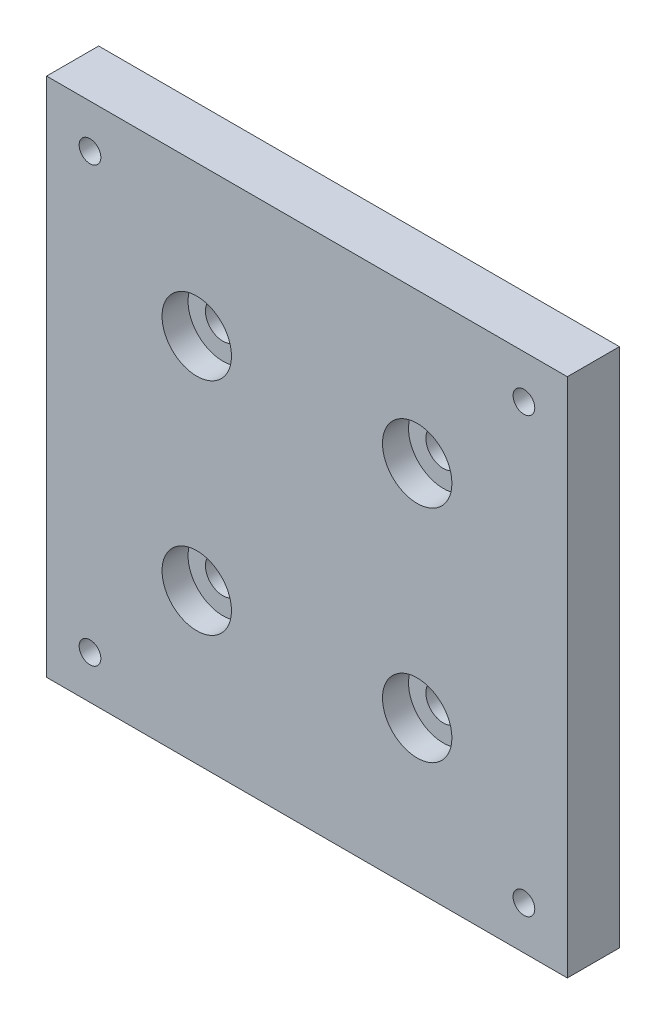
ISO-10303-21;
HEADER;
FILE_DESCRIPTION(('STEP AP214'),'2;1');
FILE_NAME('part.step','',(''),(''),'','','');
FILE_SCHEMA(('AUTOMOTIVE_DESIGN { 1 0 10303 214 1 1 1 1 }'));
ENDSEC;
DATA;
#1=APPLICATION_CONTEXT('core data for automotive mechanical design processes');
#2=APPLICATION_PROTOCOL_DEFINITION('international standard','automotive_design',2000,#1);
#3=PRODUCT_CONTEXT('',#1,'mechanical');
#4=PRODUCT('Part','Part','',(#3));
#5=PRODUCT_RELATED_PRODUCT_CATEGORY('part','',(#4));
#6=PRODUCT_DEFINITION_FORMATION('','',#4);
#7=PRODUCT_DEFINITION_CONTEXT('part definition',#1,'design');
#8=PRODUCT_DEFINITION('design','',#6,#7);
#9=PRODUCT_DEFINITION_SHAPE('','',#8);
#10=(LENGTH_UNIT() NAMED_UNIT(*) SI_UNIT(.MILLI.,.METRE.));
#11=(NAMED_UNIT(*) PLANE_ANGLE_UNIT() SI_UNIT($,.RADIAN.));
#12=(NAMED_UNIT(*) SI_UNIT($,.STERADIAN.) SOLID_ANGLE_UNIT());
#13=UNCERTAINTY_MEASURE_WITH_UNIT(LENGTH_MEASURE(1.E-05),#10,'distance_accuracy_value','');
#14=(GEOMETRIC_REPRESENTATION_CONTEXT(3) GLOBAL_UNCERTAINTY_ASSIGNED_CONTEXT((#13)) GLOBAL_UNIT_ASSIGNED_CONTEXT((#10,
#11,#12)) REPRESENTATION_CONTEXT('',''));
#15=CARTESIAN_POINT('',(0.,0.,0.));
#16=DIRECTION('',(0.,0.,1.));
#17=DIRECTION('',(1.,0.,0.));
#18=AXIS2_PLACEMENT_3D('',#15,#16,#17);
#19=CARTESIAN_POINT('',(30.,30.,6.));
#20=DIRECTION('',(-1.,0.,0.));
#21=DIRECTION('',(0.,0.,1.));
#22=AXIS2_PLACEMENT_3D('',#19,#20,#21);
#23=PLANE('',#22);
#24=DIRECTION('',(0.,1.,0.));
#25=VECTOR('',#24,1.);
#26=CARTESIAN_POINT('',(30.,30.,0.));
#27=LINE('',#26,#25);
#28=CARTESIAN_POINT('',(30.,-30.,0.));
#29=VERTEX_POINT('',#28);
#30=CARTESIAN_POINT('',(30.,30.,0.));
#31=VERTEX_POINT('',#30);
#32=EDGE_CURVE('E109',#29,#31,#27,.T.);
#33=ORIENTED_EDGE('',*,*,#32,.T.);
#34=DIRECTION('',(0.,0.,-1.));
#35=VECTOR('',#34,1.);
#36=CARTESIAN_POINT('',(30.,30.,6.));
#37=LINE('',#36,#35);
#38=CARTESIAN_POINT('',(30.,30.,6.));
#39=VERTEX_POINT('',#38);
#40=EDGE_CURVE('E11',#39,#31,#37,.T.);
#41=ORIENTED_EDGE('',*,*,#40,.F.);
#42=DIRECTION('',(0.,1.,0.));
#43=VECTOR('',#42,1.);
#44=CARTESIAN_POINT('',(30.,30.,6.));
#45=LINE('',#44,#43);
#46=CARTESIAN_POINT('',(30.,-30.,6.));
#47=VERTEX_POINT('',#46);
#48=EDGE_CURVE('E93',#47,#39,#45,.T.);
#49=ORIENTED_EDGE('',*,*,#48,.F.);
#50=DIRECTION('',(0.,0.,-1.));
#51=VECTOR('',#50,1.);
#52=CARTESIAN_POINT('',(30.,-30.,6.));
#53=LINE('',#52,#51);
#54=EDGE_CURVE('E105',#47,#29,#53,.T.);
#55=ORIENTED_EDGE('',*,*,#54,.T.);
#56=EDGE_LOOP('',(#33,#41,#49,#55));
#57=FACE_BOUND('',#56,.T.);
#58=ADVANCED_FACE('F41',(#57),#23,.F.);
#59=CARTESIAN_POINT('',(-30.,30.,6.));
#60=DIRECTION('',(0.,-1.,0.));
#61=DIRECTION('',(0.,0.,-1.));
#62=AXIS2_PLACEMENT_3D('',#59,#60,#61);
#63=PLANE('',#62);
#64=DIRECTION('',(-1.,0.,0.));
#65=VECTOR('',#64,1.);
#66=CARTESIAN_POINT('',(-30.,30.,0.));
#67=LINE('',#66,#65);
#68=CARTESIAN_POINT('',(-30.,30.,0.));
#69=VERTEX_POINT('',#68);
#70=EDGE_CURVE('E98',#31,#69,#67,.T.);
#71=ORIENTED_EDGE('',*,*,#70,.T.);
#72=DIRECTION('',(0.,0.,-1.));
#73=VECTOR('',#72,1.);
#74=CARTESIAN_POINT('',(-30.,30.,6.));
#75=LINE('',#74,#73);
#76=CARTESIAN_POINT('',(-30.,30.,6.));
#77=VERTEX_POINT('',#76);
#78=EDGE_CURVE('E50',#77,#69,#75,.T.);
#79=ORIENTED_EDGE('',*,*,#78,.F.);
#80=DIRECTION('',(-1.,0.,0.));
#81=VECTOR('',#80,1.);
#82=CARTESIAN_POINT('',(-30.,30.,6.));
#83=LINE('',#82,#81);
#84=EDGE_CURVE('E88',#39,#77,#83,.T.);
#85=ORIENTED_EDGE('',*,*,#84,.F.);
#86=ORIENTED_EDGE('',*,*,#40,.T.);
#87=EDGE_LOOP('',(#71,#79,#85,#86));
#88=FACE_BOUND('',#87,.T.);
#89=ADVANCED_FACE('F97',(#88),#63,.F.);
#90=CARTESIAN_POINT('',(-30.,30.,6.));
#91=DIRECTION('',(1.,0.,0.));
#92=DIRECTION('',(0.,1.,0.));
#93=AXIS2_PLACEMENT_3D('',#90,#91,#92);
#94=PLANE('',#93);
#95=DIRECTION('',(0.,-1.,0.));
#96=VECTOR('',#95,1.);
#97=CARTESIAN_POINT('',(-30.,30.,0.));
#98=LINE('',#97,#96);
#99=CARTESIAN_POINT('',(-30.,-30.,0.));
#100=VERTEX_POINT('',#99);
#101=EDGE_CURVE('E75',#69,#100,#98,.T.);
#102=ORIENTED_EDGE('',*,*,#101,.T.);
#103=DIRECTION('',(0.,0.,-1.));
#104=VECTOR('',#103,1.);
#105=CARTESIAN_POINT('',(-30.,-30.,6.));
#106=LINE('',#105,#104);
#107=CARTESIAN_POINT('',(-30.,-30.,6.));
#108=VERTEX_POINT('',#107);
#109=EDGE_CURVE('E100',#108,#100,#106,.T.);
#110=ORIENTED_EDGE('',*,*,#109,.F.);
#111=DIRECTION('',(0.,-1.,0.));
#112=VECTOR('',#111,1.);
#113=CARTESIAN_POINT('',(-30.,30.,6.));
#114=LINE('',#113,#112);
#115=EDGE_CURVE('E91',#77,#108,#114,.T.);
#116=ORIENTED_EDGE('',*,*,#115,.F.);
#117=ORIENTED_EDGE('',*,*,#78,.T.);
#118=EDGE_LOOP('',(#102,#110,#116,#117));
#119=FACE_BOUND('',#118,.T.);
#120=ADVANCED_FACE('F101',(#119),#94,.F.);
#121=CARTESIAN_POINT('',(-30.,-30.,6.));
#122=DIRECTION('',(0.,1.,0.));
#123=DIRECTION('',(0.,0.,1.));
#124=AXIS2_PLACEMENT_3D('',#121,#122,#123);
#125=PLANE('',#124);
#126=DIRECTION('',(1.,0.,0.));
#127=VECTOR('',#126,1.);
#128=CARTESIAN_POINT('',(-30.,-30.,0.));
#129=LINE('',#128,#127);
#130=EDGE_CURVE('E81',#100,#29,#129,.T.);
#131=ORIENTED_EDGE('',*,*,#130,.T.);
#132=ORIENTED_EDGE('',*,*,#54,.F.);
#133=DIRECTION('',(1.,0.,0.));
#134=VECTOR('',#133,1.);
#135=CARTESIAN_POINT('',(-30.,-30.,6.));
#136=LINE('',#135,#134);
#137=EDGE_CURVE('E58',#108,#47,#136,.T.);
#138=ORIENTED_EDGE('',*,*,#137,.F.);
#139=ORIENTED_EDGE('',*,*,#109,.T.);
#140=EDGE_LOOP('',(#131,#132,#138,#139));
#141=FACE_BOUND('',#140,.T.);
#142=ADVANCED_FACE('F123',(#141),#125,.F.);
#143=CARTESIAN_POINT('',(0.,0.,6.));
#144=DIRECTION('',(0.,0.,1.));
#145=DIRECTION('',(1.,0.,0.));
#146=AXIS2_PLACEMENT_3D('',#143,#144,#145);
#147=PLANE('',#146);
#148=CARTESIAN_POINT('',(-12.7,12.7,6.));
#149=DIRECTION('',(0.,0.,1.));
#150=DIRECTION('',(1.,0.,0.));
#151=AXIS2_PLACEMENT_3D('',#148,#149,#150);
#152=CIRCLE('',#151,4.00000000000001);
#153=CARTESIAN_POINT('',(-8.69999999999999,12.7,6.));
#154=VERTEX_POINT('',#153);
#155=EDGE_CURVE('E221',#154,#154,#152,.T.);
#156=ORIENTED_EDGE('',*,*,#155,.F.);
#157=EDGE_LOOP('',(#156));
#158=FACE_BOUND('',#157,.T.);
#159=CARTESIAN_POINT('',(12.7,12.7,6.));
#160=DIRECTION('',(0.,0.,1.));
#161=DIRECTION('',(1.,0.,0.));
#162=AXIS2_PLACEMENT_3D('',#159,#160,#161);
#163=CIRCLE('',#162,4.00000000000001);
#164=CARTESIAN_POINT('',(16.7,12.7,6.));
#165=VERTEX_POINT('',#164);
#166=EDGE_CURVE('E205',#165,#165,#163,.T.);
#167=ORIENTED_EDGE('',*,*,#166,.F.);
#168=EDGE_LOOP('',(#167));
#169=FACE_BOUND('',#168,.T.);
#170=CARTESIAN_POINT('',(12.7,-12.7,6.));
#171=DIRECTION('',(0.,0.,1.));
#172=DIRECTION('',(1.,0.,0.));
#173=AXIS2_PLACEMENT_3D('',#170,#171,#172);
#174=CIRCLE('',#173,4.00000000000001);
#175=CARTESIAN_POINT('',(16.7,-12.7,6.));
#176=VERTEX_POINT('',#175);
#177=EDGE_CURVE('E189',#176,#176,#174,.T.);
#178=ORIENTED_EDGE('',*,*,#177,.F.);
#179=EDGE_LOOP('',(#178));
#180=FACE_BOUND('',#179,.T.);
#181=CARTESIAN_POINT('',(-12.7,-12.7,6.));
#182=DIRECTION('',(0.,0.,1.));
#183=DIRECTION('',(1.,0.,0.));
#184=AXIS2_PLACEMENT_3D('',#181,#182,#183);
#185=CIRCLE('',#184,4.00000000000001);
#186=CARTESIAN_POINT('',(-8.69999999999999,-12.7,6.));
#187=VERTEX_POINT('',#186);
#188=EDGE_CURVE('E173',#187,#187,#185,.T.);
#189=ORIENTED_EDGE('',*,*,#188,.F.);
#190=EDGE_LOOP('',(#189));
#191=FACE_BOUND('',#190,.T.);
#192=CARTESIAN_POINT('',(-25.,25.,6.));
#193=DIRECTION('',(0.,0.,1.));
#194=DIRECTION('',(1.,0.,0.));
#195=AXIS2_PLACEMENT_3D('',#192,#193,#194);
#196=CIRCLE('',#195,1.24999999999999);
#197=CARTESIAN_POINT('',(-23.75,25.,6.));
#198=VERTEX_POINT('',#197);
#199=EDGE_CURVE('E157',#198,#198,#196,.T.);
#200=ORIENTED_EDGE('',*,*,#199,.F.);
#201=EDGE_LOOP('',(#200));
#202=FACE_BOUND('',#201,.T.);
#203=CARTESIAN_POINT('',(25.,25.,6.));
#204=DIRECTION('',(0.,0.,1.));
#205=DIRECTION('',(1.,0.,0.));
#206=AXIS2_PLACEMENT_3D('',#203,#204,#205);
#207=CIRCLE('',#206,1.24999999999999);
#208=CARTESIAN_POINT('',(26.25,25.,6.));
#209=VERTEX_POINT('',#208);
#210=EDGE_CURVE('E149',#209,#209,#207,.T.);
#211=ORIENTED_EDGE('',*,*,#210,.F.);
#212=EDGE_LOOP('',(#211));
#213=FACE_BOUND('',#212,.T.);
#214=CARTESIAN_POINT('',(25.,-25.,6.));
#215=DIRECTION('',(0.,0.,1.));
#216=DIRECTION('',(1.,0.,0.));
#217=AXIS2_PLACEMENT_3D('',#214,#215,#216);
#218=CIRCLE('',#217,1.24999999999999);
#219=CARTESIAN_POINT('',(26.25,-25.,6.));
#220=VERTEX_POINT('',#219);
#221=EDGE_CURVE('E141',#220,#220,#218,.T.);
#222=ORIENTED_EDGE('',*,*,#221,.F.);
#223=EDGE_LOOP('',(#222));
#224=FACE_BOUND('',#223,.T.);
#225=CARTESIAN_POINT('',(-25.,-25.,6.));
#226=DIRECTION('',(0.,0.,1.));
#227=DIRECTION('',(1.,0.,0.));
#228=AXIS2_PLACEMENT_3D('',#225,#226,#227);
#229=CIRCLE('',#228,1.24999999999999);
#230=CARTESIAN_POINT('',(-23.75,-25.,6.));
#231=VERTEX_POINT('',#230);
#232=EDGE_CURVE('E133',#231,#231,#229,.T.);
#233=ORIENTED_EDGE('',*,*,#232,.F.);
#234=EDGE_LOOP('',(#233));
#235=FACE_BOUND('',#234,.T.);
#236=ORIENTED_EDGE('',*,*,#48,.T.);
#237=ORIENTED_EDGE('',*,*,#84,.T.);
#238=ORIENTED_EDGE('',*,*,#115,.T.);
#239=ORIENTED_EDGE('',*,*,#137,.T.);
#240=EDGE_LOOP('',(#236,#237,#238,#239));
#241=FACE_BOUND('',#240,.T.);
#242=ADVANCED_FACE('F89',(#158,#169,#180,#191,#202,#213,#224,#235,#241),#147,.T.);
#243=CARTESIAN_POINT('',(0.,0.,0.));
#244=DIRECTION('',(0.,0.,1.));
#245=DIRECTION('',(1.,0.,0.));
#246=AXIS2_PLACEMENT_3D('',#243,#244,#245);
#247=PLANE('',#246);
#248=CARTESIAN_POINT('',(-12.7,12.7,0.));
#249=DIRECTION('',(0.,0.,1.));
#250=DIRECTION('',(1.,0.,0.));
#251=AXIS2_PLACEMENT_3D('',#248,#249,#250);
#252=CIRCLE('',#251,2.00000000000001);
#253=CARTESIAN_POINT('',(-10.7,12.7,0.));
#254=VERTEX_POINT('',#253);
#255=EDGE_CURVE('E209',#254,#254,#252,.T.);
#256=ORIENTED_EDGE('',*,*,#255,.T.);
#257=EDGE_LOOP('',(#256));
#258=FACE_BOUND('',#257,.T.);
#259=CARTESIAN_POINT('',(12.7,12.7,0.));
#260=DIRECTION('',(0.,0.,1.));
#261=DIRECTION('',(1.,0.,0.));
#262=AXIS2_PLACEMENT_3D('',#259,#260,#261);
#263=CIRCLE('',#262,2.00000000000001);
#264=CARTESIAN_POINT('',(14.7,12.7,0.));
#265=VERTEX_POINT('',#264);
#266=EDGE_CURVE('E193',#265,#265,#263,.T.);
#267=ORIENTED_EDGE('',*,*,#266,.T.);
#268=EDGE_LOOP('',(#267));
#269=FACE_BOUND('',#268,.T.);
#270=CARTESIAN_POINT('',(12.7,-12.7,0.));
#271=DIRECTION('',(0.,0.,1.));
#272=DIRECTION('',(1.,0.,0.));
#273=AXIS2_PLACEMENT_3D('',#270,#271,#272);
#274=CIRCLE('',#273,2.00000000000001);
#275=CARTESIAN_POINT('',(14.7,-12.7,0.));
#276=VERTEX_POINT('',#275);
#277=EDGE_CURVE('E177',#276,#276,#274,.T.);
#278=ORIENTED_EDGE('',*,*,#277,.T.);
#279=EDGE_LOOP('',(#278));
#280=FACE_BOUND('',#279,.T.);
#281=CARTESIAN_POINT('',(-12.7,-12.7,0.));
#282=DIRECTION('',(0.,0.,1.));
#283=DIRECTION('',(1.,0.,0.));
#284=AXIS2_PLACEMENT_3D('',#281,#282,#283);
#285=CIRCLE('',#284,2.00000000000001);
#286=CARTESIAN_POINT('',(-10.7,-12.7,0.));
#287=VERTEX_POINT('',#286);
#288=EDGE_CURVE('E161',#287,#287,#285,.T.);
#289=ORIENTED_EDGE('',*,*,#288,.T.);
#290=EDGE_LOOP('',(#289));
#291=FACE_BOUND('',#290,.T.);
#292=CARTESIAN_POINT('',(-25.,25.,0.));
#293=DIRECTION('',(0.,0.,1.));
#294=DIRECTION('',(1.,0.,0.));
#295=AXIS2_PLACEMENT_3D('',#292,#293,#294);
#296=CIRCLE('',#295,1.25);
#297=CARTESIAN_POINT('',(-23.75,25.,0.));
#298=VERTEX_POINT('',#297);
#299=EDGE_CURVE('E153',#298,#298,#296,.T.);
#300=ORIENTED_EDGE('',*,*,#299,.T.);
#301=EDGE_LOOP('',(#300));
#302=FACE_BOUND('',#301,.T.);
#303=CARTESIAN_POINT('',(25.,25.,0.));
#304=DIRECTION('',(0.,0.,1.));
#305=DIRECTION('',(1.,0.,0.));
#306=AXIS2_PLACEMENT_3D('',#303,#304,#305);
#307=CIRCLE('',#306,1.25);
#308=CARTESIAN_POINT('',(26.25,25.,0.));
#309=VERTEX_POINT('',#308);
#310=EDGE_CURVE('E145',#309,#309,#307,.T.);
#311=ORIENTED_EDGE('',*,*,#310,.T.);
#312=EDGE_LOOP('',(#311));
#313=FACE_BOUND('',#312,.T.);
#314=CARTESIAN_POINT('',(25.,-25.,0.));
#315=DIRECTION('',(0.,0.,1.));
#316=DIRECTION('',(1.,0.,0.));
#317=AXIS2_PLACEMENT_3D('',#314,#315,#316);
#318=CIRCLE('',#317,1.25);
#319=CARTESIAN_POINT('',(26.25,-25.,0.));
#320=VERTEX_POINT('',#319);
#321=EDGE_CURVE('E137',#320,#320,#318,.T.);
#322=ORIENTED_EDGE('',*,*,#321,.T.);
#323=EDGE_LOOP('',(#322));
#324=FACE_BOUND('',#323,.T.);
#325=CARTESIAN_POINT('',(-25.,-25.,0.));
#326=DIRECTION('',(0.,0.,1.));
#327=DIRECTION('',(1.,0.,0.));
#328=AXIS2_PLACEMENT_3D('',#325,#326,#327);
#329=CIRCLE('',#328,1.25);
#330=CARTESIAN_POINT('',(-23.75,-25.,0.));
#331=VERTEX_POINT('',#330);
#332=EDGE_CURVE('E113',#331,#331,#329,.T.);
#333=ORIENTED_EDGE('',*,*,#332,.T.);
#334=EDGE_LOOP('',(#333));
#335=FACE_BOUND('',#334,.T.);
#336=ORIENTED_EDGE('',*,*,#32,.F.);
#337=ORIENTED_EDGE('',*,*,#130,.F.);
#338=ORIENTED_EDGE('',*,*,#101,.F.);
#339=ORIENTED_EDGE('',*,*,#70,.F.);
#340=EDGE_LOOP('',(#336,#337,#338,#339));
#341=FACE_BOUND('',#340,.T.);
#342=ADVANCED_FACE('F126',(#258,#269,#280,#291,#302,#313,#324,#335,#341),#247,.F.);
#343=CARTESIAN_POINT('',(-25.,-25.,6.));
#344=DIRECTION('',(0.,0.,1.));
#345=DIRECTION('',(1.,0.,0.));
#346=AXIS2_PLACEMENT_3D('',#343,#344,#345);
#347=CYLINDRICAL_SURFACE('',#346,1.24999999999999);
#348=ORIENTED_EDGE('',*,*,#332,.F.);
#349=EDGE_LOOP('',(#348));
#350=FACE_BOUND('',#349,.T.);
#351=ORIENTED_EDGE('',*,*,#232,.T.);
#352=EDGE_LOOP('',(#351));
#353=FACE_BOUND('',#352,.T.);
#354=ADVANCED_FACE('F245',(#350,#353),#347,.F.);
#355=CARTESIAN_POINT('',(25.,-25.,6.));
#356=DIRECTION('',(0.,0.,1.));
#357=DIRECTION('',(1.,0.,0.));
#358=AXIS2_PLACEMENT_3D('',#355,#356,#357);
#359=CYLINDRICAL_SURFACE('',#358,1.24999999999999);
#360=ORIENTED_EDGE('',*,*,#321,.F.);
#361=EDGE_LOOP('',(#360));
#362=FACE_BOUND('',#361,.T.);
#363=ORIENTED_EDGE('',*,*,#221,.T.);
#364=EDGE_LOOP('',(#363));
#365=FACE_BOUND('',#364,.T.);
#366=ADVANCED_FACE('F247',(#362,#365),#359,.F.);
#367=CARTESIAN_POINT('',(25.,25.,6.));
#368=DIRECTION('',(0.,0.,1.));
#369=DIRECTION('',(1.,0.,0.));
#370=AXIS2_PLACEMENT_3D('',#367,#368,#369);
#371=CYLINDRICAL_SURFACE('',#370,1.24999999999999);
#372=ORIENTED_EDGE('',*,*,#310,.F.);
#373=EDGE_LOOP('',(#372));
#374=FACE_BOUND('',#373,.T.);
#375=ORIENTED_EDGE('',*,*,#210,.T.);
#376=EDGE_LOOP('',(#375));
#377=FACE_BOUND('',#376,.T.);
#378=ADVANCED_FACE('F254',(#374,#377),#371,.F.);
#379=CARTESIAN_POINT('',(-25.,25.,6.));
#380=DIRECTION('',(0.,0.,1.));
#381=DIRECTION('',(1.,0.,0.));
#382=AXIS2_PLACEMENT_3D('',#379,#380,#381);
#383=CYLINDRICAL_SURFACE('',#382,1.24999999999999);
#384=ORIENTED_EDGE('',*,*,#299,.F.);
#385=EDGE_LOOP('',(#384));
#386=FACE_BOUND('',#385,.T.);
#387=ORIENTED_EDGE('',*,*,#199,.T.);
#388=EDGE_LOOP('',(#387));
#389=FACE_BOUND('',#388,.T.);
#390=ADVANCED_FACE('F296',(#386,#389),#383,.F.);
#391=CARTESIAN_POINT('',(-12.7,-12.7,6.));
#392=DIRECTION('',(0.,0.,1.));
#393=DIRECTION('',(1.,0.,0.));
#394=AXIS2_PLACEMENT_3D('',#391,#392,#393);
#395=CYLINDRICAL_SURFACE('',#394,2.00000000000001);
#396=ORIENTED_EDGE('',*,*,#288,.F.);
#397=EDGE_LOOP('',(#396));
#398=FACE_BOUND('',#397,.T.);
#399=CARTESIAN_POINT('',(-12.7,-12.7,3.));
#400=DIRECTION('',(0.,0.,1.));
#401=DIRECTION('',(1.,0.,0.));
#402=AXIS2_PLACEMENT_3D('',#399,#400,#401);
#403=CIRCLE('',#402,2.00000000000001);
#404=CARTESIAN_POINT('',(-10.7,-12.7,3.));
#405=VERTEX_POINT('',#404);
#406=EDGE_CURVE('E165',#405,#405,#403,.T.);
#407=ORIENTED_EDGE('',*,*,#406,.T.);
#408=EDGE_LOOP('',(#407));
#409=FACE_BOUND('',#408,.T.);
#410=ADVANCED_FACE('F290',(#398,#409),#395,.F.);
#411=CARTESIAN_POINT('',(-10.7,-12.7,3.));
#412=DIRECTION('',(0.,0.,-1.));
#413=DIRECTION('',(-1.,0.,0.));
#414=AXIS2_PLACEMENT_3D('',#411,#412,#413);
#415=PLANE('',#414);
#416=ORIENTED_EDGE('',*,*,#406,.F.);
#417=EDGE_LOOP('',(#416));
#418=FACE_BOUND('',#417,.T.);
#419=CARTESIAN_POINT('',(-12.7,-12.7,3.));
#420=DIRECTION('',(0.,0.,1.));
#421=DIRECTION('',(1.,0.,0.));
#422=AXIS2_PLACEMENT_3D('',#419,#420,#421);
#423=CIRCLE('',#422,4.00000000000001);
#424=CARTESIAN_POINT('',(-8.69999999999999,-12.7,3.));
#425=VERTEX_POINT('',#424);
#426=EDGE_CURVE('E169',#425,#425,#423,.T.);
#427=ORIENTED_EDGE('',*,*,#426,.T.);
#428=EDGE_LOOP('',(#427));
#429=FACE_BOUND('',#428,.T.);
#430=ADVANCED_FACE('F295',(#418,#429),#415,.F.);
#431=CARTESIAN_POINT('',(-12.7,-12.7,6.));
#432=DIRECTION('',(0.,0.,1.));
#433=DIRECTION('',(1.,0.,0.));
#434=AXIS2_PLACEMENT_3D('',#431,#432,#433);
#435=CYLINDRICAL_SURFACE('',#434,4.00000000000001);
#436=ORIENTED_EDGE('',*,*,#426,.F.);
#437=EDGE_LOOP('',(#436));
#438=FACE_BOUND('',#437,.T.);
#439=ORIENTED_EDGE('',*,*,#188,.T.);
#440=EDGE_LOOP('',(#439));
#441=FACE_BOUND('',#440,.T.);
#442=ADVANCED_FACE('F308',(#438,#441),#435,.F.);
#443=CARTESIAN_POINT('',(12.7,-12.7,6.));
#444=DIRECTION('',(0.,0.,1.));
#445=DIRECTION('',(1.,0.,0.));
#446=AXIS2_PLACEMENT_3D('',#443,#444,#445);
#447=CYLINDRICAL_SURFACE('',#446,2.00000000000001);
#448=ORIENTED_EDGE('',*,*,#277,.F.);
#449=EDGE_LOOP('',(#448));
#450=FACE_BOUND('',#449,.T.);
#451=CARTESIAN_POINT('',(12.7,-12.7,3.));
#452=DIRECTION('',(0.,0.,1.));
#453=DIRECTION('',(1.,0.,0.));
#454=AXIS2_PLACEMENT_3D('',#451,#452,#453);
#455=CIRCLE('',#454,2.00000000000001);
#456=CARTESIAN_POINT('',(14.7,-12.7,3.));
#457=VERTEX_POINT('',#456);
#458=EDGE_CURVE('E181',#457,#457,#455,.T.);
#459=ORIENTED_EDGE('',*,*,#458,.T.);
#460=EDGE_LOOP('',(#459));
#461=FACE_BOUND('',#460,.T.);
#462=ADVANCED_FACE('F318',(#450,#461),#447,.F.);
#463=CARTESIAN_POINT('',(14.7,-12.7,3.));
#464=DIRECTION('',(0.,0.,-1.));
#465=DIRECTION('',(-1.,0.,0.));
#466=AXIS2_PLACEMENT_3D('',#463,#464,#465);
#467=PLANE('',#466);
#468=ORIENTED_EDGE('',*,*,#458,.F.);
#469=EDGE_LOOP('',(#468));
#470=FACE_BOUND('',#469,.T.);
#471=CARTESIAN_POINT('',(12.7,-12.7,3.));
#472=DIRECTION('',(0.,0.,1.));
#473=DIRECTION('',(1.,0.,0.));
#474=AXIS2_PLACEMENT_3D('',#471,#472,#473);
#475=CIRCLE('',#474,4.00000000000001);
#476=CARTESIAN_POINT('',(16.7,-12.7,3.));
#477=VERTEX_POINT('',#476);
#478=EDGE_CURVE('E185',#477,#477,#475,.T.);
#479=ORIENTED_EDGE('',*,*,#478,.T.);
#480=EDGE_LOOP('',(#479));
#481=FACE_BOUND('',#480,.T.);
#482=ADVANCED_FACE('F328',(#470,#481),#467,.F.);
#483=CARTESIAN_POINT('',(12.7,-12.7,6.));
#484=DIRECTION('',(0.,0.,1.));
#485=DIRECTION('',(1.,0.,0.));
#486=AXIS2_PLACEMENT_3D('',#483,#484,#485);
#487=CYLINDRICAL_SURFACE('',#486,4.00000000000001);
#488=ORIENTED_EDGE('',*,*,#478,.F.);
#489=EDGE_LOOP('',(#488));
#490=FACE_BOUND('',#489,.T.);
#491=ORIENTED_EDGE('',*,*,#177,.T.);
#492=EDGE_LOOP('',(#491));
#493=FACE_BOUND('',#492,.T.);
#494=ADVANCED_FACE('F338',(#490,#493),#487,.F.);
#495=CARTESIAN_POINT('',(12.7,12.7,6.));
#496=DIRECTION('',(0.,0.,1.));
#497=DIRECTION('',(1.,0.,0.));
#498=AXIS2_PLACEMENT_3D('',#495,#496,#497);
#499=CYLINDRICAL_SURFACE('',#498,2.00000000000001);
#500=ORIENTED_EDGE('',*,*,#266,.F.);
#501=EDGE_LOOP('',(#500));
#502=FACE_BOUND('',#501,.T.);
#503=CARTESIAN_POINT('',(12.7,12.7,3.));
#504=DIRECTION('',(0.,0.,1.));
#505=DIRECTION('',(1.,0.,0.));
#506=AXIS2_PLACEMENT_3D('',#503,#504,#505);
#507=CIRCLE('',#506,2.00000000000001);
#508=CARTESIAN_POINT('',(14.7,12.7,3.));
#509=VERTEX_POINT('',#508);
#510=EDGE_CURVE('E197',#509,#509,#507,.T.);
#511=ORIENTED_EDGE('',*,*,#510,.T.);
#512=EDGE_LOOP('',(#511));
#513=FACE_BOUND('',#512,.T.);
#514=ADVANCED_FACE('F348',(#502,#513),#499,.F.);
#515=CARTESIAN_POINT('',(14.7,12.7,3.));
#516=DIRECTION('',(0.,0.,-1.));
#517=DIRECTION('',(-1.,0.,0.));
#518=AXIS2_PLACEMENT_3D('',#515,#516,#517);
#519=PLANE('',#518);
#520=ORIENTED_EDGE('',*,*,#510,.F.);
#521=EDGE_LOOP('',(#520));
#522=FACE_BOUND('',#521,.T.);
#523=CARTESIAN_POINT('',(12.7,12.7,3.));
#524=DIRECTION('',(0.,0.,1.));
#525=DIRECTION('',(1.,0.,0.));
#526=AXIS2_PLACEMENT_3D('',#523,#524,#525);
#527=CIRCLE('',#526,4.00000000000001);
#528=CARTESIAN_POINT('',(16.7,12.7,3.));
#529=VERTEX_POINT('',#528);
#530=EDGE_CURVE('E201',#529,#529,#527,.T.);
#531=ORIENTED_EDGE('',*,*,#530,.T.);
#532=EDGE_LOOP('',(#531));
#533=FACE_BOUND('',#532,.T.);
#534=ADVANCED_FACE('F358',(#522,#533),#519,.F.);
#535=CARTESIAN_POINT('',(12.7,12.7,6.));
#536=DIRECTION('',(0.,0.,1.));
#537=DIRECTION('',(1.,0.,0.));
#538=AXIS2_PLACEMENT_3D('',#535,#536,#537);
#539=CYLINDRICAL_SURFACE('',#538,4.00000000000001);
#540=ORIENTED_EDGE('',*,*,#530,.F.);
#541=EDGE_LOOP('',(#540));
#542=FACE_BOUND('',#541,.T.);
#543=ORIENTED_EDGE('',*,*,#166,.T.);
#544=EDGE_LOOP('',(#543));
#545=FACE_BOUND('',#544,.T.);
#546=ADVANCED_FACE('F368',(#542,#545),#539,.F.);
#547=CARTESIAN_POINT('',(-12.7,12.7,6.));
#548=DIRECTION('',(0.,0.,1.));
#549=DIRECTION('',(1.,0.,0.));
#550=AXIS2_PLACEMENT_3D('',#547,#548,#549);
#551=CYLINDRICAL_SURFACE('',#550,2.00000000000001);
#552=ORIENTED_EDGE('',*,*,#255,.F.);
#553=EDGE_LOOP('',(#552));
#554=FACE_BOUND('',#553,.T.);
#555=CARTESIAN_POINT('',(-12.7,12.7,3.));
#556=DIRECTION('',(0.,0.,1.));
#557=DIRECTION('',(1.,0.,0.));
#558=AXIS2_PLACEMENT_3D('',#555,#556,#557);
#559=CIRCLE('',#558,2.00000000000001);
#560=CARTESIAN_POINT('',(-10.7,12.7,3.));
#561=VERTEX_POINT('',#560);
#562=EDGE_CURVE('E213',#561,#561,#559,.T.);
#563=ORIENTED_EDGE('',*,*,#562,.T.);
#564=EDGE_LOOP('',(#563));
#565=FACE_BOUND('',#564,.T.);
#566=ADVANCED_FACE('F378',(#554,#565),#551,.F.);
#567=CARTESIAN_POINT('',(-10.7,12.7,3.));
#568=DIRECTION('',(0.,0.,-1.));
#569=DIRECTION('',(-1.,0.,0.));
#570=AXIS2_PLACEMENT_3D('',#567,#568,#569);
#571=PLANE('',#570);
#572=ORIENTED_EDGE('',*,*,#562,.F.);
#573=EDGE_LOOP('',(#572));
#574=FACE_BOUND('',#573,.T.);
#575=CARTESIAN_POINT('',(-12.7,12.7,3.));
#576=DIRECTION('',(0.,0.,1.));
#577=DIRECTION('',(1.,0.,0.));
#578=AXIS2_PLACEMENT_3D('',#575,#576,#577);
#579=CIRCLE('',#578,4.00000000000001);
#580=CARTESIAN_POINT('',(-8.69999999999999,12.7,3.));
#581=VERTEX_POINT('',#580);
#582=EDGE_CURVE('E217',#581,#581,#579,.T.);
#583=ORIENTED_EDGE('',*,*,#582,.T.);
#584=EDGE_LOOP('',(#583));
#585=FACE_BOUND('',#584,.T.);
#586=ADVANCED_FACE('F388',(#574,#585),#571,.F.);
#587=CARTESIAN_POINT('',(-12.7,12.7,6.));
#588=DIRECTION('',(0.,0.,1.));
#589=DIRECTION('',(1.,0.,0.));
#590=AXIS2_PLACEMENT_3D('',#587,#588,#589);
#591=CYLINDRICAL_SURFACE('',#590,4.00000000000001);
#592=ORIENTED_EDGE('',*,*,#582,.F.);
#593=EDGE_LOOP('',(#592));
#594=FACE_BOUND('',#593,.T.);
#595=ORIENTED_EDGE('',*,*,#155,.T.);
#596=EDGE_LOOP('',(#595));
#597=FACE_BOUND('',#596,.T.);
#598=ADVANCED_FACE('F226',(#594,#597),#591,.F.);
#599=CLOSED_SHELL('',(#58,#89,#120,#142,#242,#342,#354,#366,#378,#390,#410,#430,#442,#462,#482,
#494,#514,#534,#546,#566,#586,#598));
#600=MANIFOLD_SOLID_BREP('B2',#599);
#601=ADVANCED_BREP_SHAPE_REPRESENTATION('',(#18,#600),#14);
#602=SHAPE_DEFINITION_REPRESENTATION(#9,#601);
ENDSEC;
END-ISO-10303-21;
